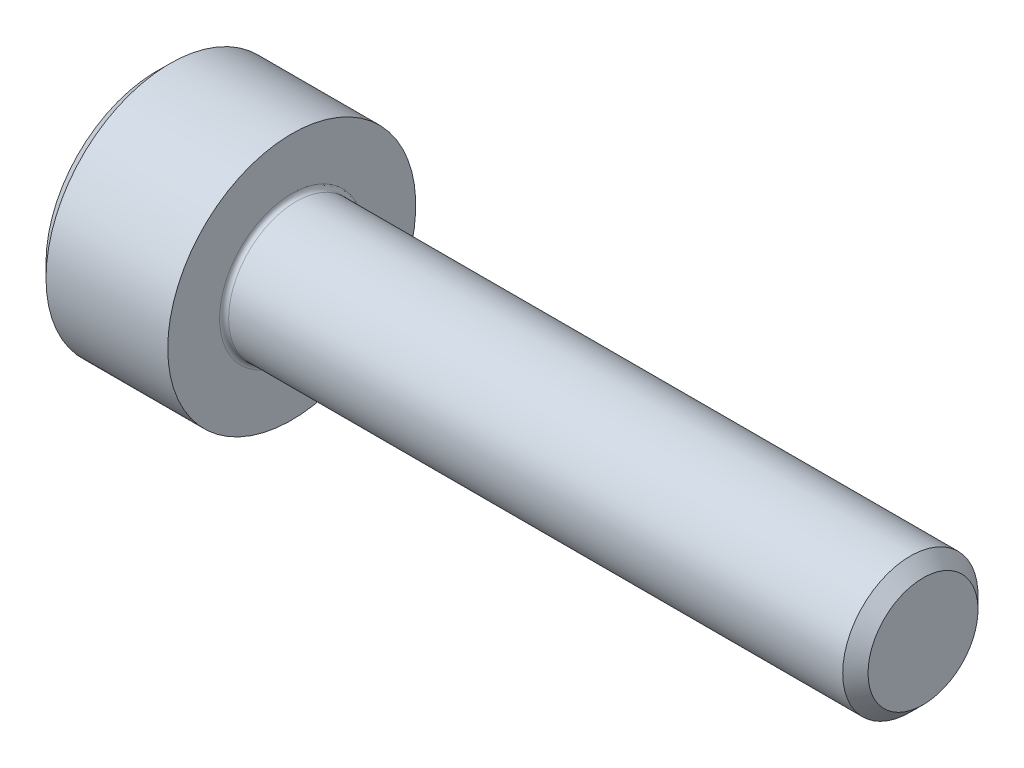
ISO-10303-21;
HEADER;
FILE_DESCRIPTION(('STEP AP214'),'2;1');
FILE_NAME('part.step','',(''),(''),'','','');
FILE_SCHEMA(('AUTOMOTIVE_DESIGN { 1 0 10303 214 1 1 1 1 }'));
ENDSEC;
DATA;
#1=APPLICATION_CONTEXT('core data for automotive mechanical design processes');
#2=APPLICATION_PROTOCOL_DEFINITION('international standard','automotive_design',2000,#1);
#3=PRODUCT_CONTEXT('',#1,'mechanical');
#4=PRODUCT('Part','Part','',(#3));
#5=PRODUCT_RELATED_PRODUCT_CATEGORY('part','',(#4));
#6=PRODUCT_DEFINITION_FORMATION('','',#4);
#7=PRODUCT_DEFINITION_CONTEXT('part definition',#1,'design');
#8=PRODUCT_DEFINITION('design','',#6,#7);
#9=PRODUCT_DEFINITION_SHAPE('','',#8);
#10=(LENGTH_UNIT() NAMED_UNIT(*) SI_UNIT(.MILLI.,.METRE.));
#11=(NAMED_UNIT(*) PLANE_ANGLE_UNIT() SI_UNIT($,.RADIAN.));
#12=(NAMED_UNIT(*) SI_UNIT($,.STERADIAN.) SOLID_ANGLE_UNIT());
#13=UNCERTAINTY_MEASURE_WITH_UNIT(LENGTH_MEASURE(1.E-05),#10,'distance_accuracy_value','');
#14=(GEOMETRIC_REPRESENTATION_CONTEXT(3) GLOBAL_UNCERTAINTY_ASSIGNED_CONTEXT((#13)) GLOBAL_UNIT_ASSIGNED_CONTEXT((#10,
#11,#12)) REPRESENTATION_CONTEXT('',''));
#15=CARTESIAN_POINT('',(0.,0.,0.));
#16=DIRECTION('',(0.,0.,1.));
#17=DIRECTION('',(1.,0.,0.));
#18=AXIS2_PLACEMENT_3D('',#15,#16,#17);
#19=CARTESIAN_POINT('',(0.,0.,0.));
#20=DIRECTION('',(-1.,0.,0.));
#21=DIRECTION('',(0.,0.,1.));
#22=AXIS2_PLACEMENT_3D('',#19,#20,#21);
#23=PLANE('',#22);
#24=DIRECTION('',(0.,-0.5,0.866025403784439));
#25=VECTOR('',#24,1.);
#26=CARTESIAN_POINT('',(0.,1.47801668912544,0.));
#27=LINE('',#26,#25);
#28=CARTESIAN_POINT('',(0.,1.47801668912544,0.));
#29=VERTEX_POINT('',#28);
#30=CARTESIAN_POINT('',(0.,0.739008344562719,1.28));
#31=VERTEX_POINT('',#30);
#32=EDGE_CURVE('E376',#29,#31,#27,.T.);
#33=ORIENTED_EDGE('',*,*,#32,.T.);
#34=DIRECTION('',(0.,1.,0.));
#35=VECTOR('',#34,1.);
#36=CARTESIAN_POINT('',(0.,-0.739008344562723,1.28));
#37=LINE('',#36,#35);
#38=CARTESIAN_POINT('',(0.,-0.739008344562723,1.28));
#39=VERTEX_POINT('',#38);
#40=EDGE_CURVE('E132',#39,#31,#37,.T.);
#41=ORIENTED_EDGE('',*,*,#40,.F.);
#42=DIRECTION('',(0.,-0.500000000000001,-0.866025403784438));
#43=VECTOR('',#42,1.);
#44=CARTESIAN_POINT('',(0.,-0.739008344562723,1.28));
#45=LINE('',#44,#43);
#46=CARTESIAN_POINT('',(0.,-1.47801668912545,0.));
#47=VERTEX_POINT('',#46);
#48=EDGE_CURVE('E379',#39,#47,#45,.T.);
#49=ORIENTED_EDGE('',*,*,#48,.T.);
#50=DIRECTION('',(0.,0.5,-0.866025403784439));
#51=VECTOR('',#50,1.);
#52=CARTESIAN_POINT('',(0.,-1.47801668912545,0.));
#53=LINE('',#52,#51);
#54=CARTESIAN_POINT('',(0.,-0.739008344562725,-1.28));
#55=VERTEX_POINT('',#54);
#56=EDGE_CURVE('E382',#47,#55,#53,.T.);
#57=ORIENTED_EDGE('',*,*,#56,.T.);
#58=DIRECTION('',(0.,-1.,0.));
#59=VECTOR('',#58,1.);
#60=CARTESIAN_POINT('',(0.,0.739008344562717,-1.28));
#61=LINE('',#60,#59);
#62=CARTESIAN_POINT('',(0.,0.739008344562717,-1.28));
#63=VERTEX_POINT('',#62);
#64=EDGE_CURVE('E385',#63,#55,#61,.T.);
#65=ORIENTED_EDGE('',*,*,#64,.F.);
#66=DIRECTION('',(0.,-0.500000000000001,-0.866025403784438));
#67=VECTOR('',#66,1.);
#68=CARTESIAN_POINT('',(0.,1.47801668912544,0.));
#69=LINE('',#68,#67);
#70=EDGE_CURVE('E127',#29,#63,#69,.T.);
#71=ORIENTED_EDGE('',*,*,#70,.F.);
#72=EDGE_LOOP('',(#33,#41,#49,#57,#65,#71));
#73=FACE_BOUND('',#72,.T.);
#74=CARTESIAN_POINT('',(0.,0.,0.));
#75=DIRECTION('',(-1.,0.,0.));
#76=DIRECTION('',(0.,0.,1.));
#77=AXIS2_PLACEMENT_3D('',#74,#75,#76);
#78=CIRCLE('',#77,2.45);
#79=CARTESIAN_POINT('',(0.,0.,2.45));
#80=VERTEX_POINT('',#79);
#81=EDGE_CURVE('E143',#80,#80,#78,.T.);
#82=ORIENTED_EDGE('',*,*,#81,.T.);
#83=EDGE_LOOP('',(#82));
#84=FACE_BOUND('',#83,.T.);
#85=ADVANCED_FACE('F36',(#73,#84),#23,.T.);
#86=CARTESIAN_POINT('',(17.,1.2195,0.));
#87=DIRECTION('',(1.,0.,0.));
#88=DIRECTION('',(0.,0.,-1.));
#89=AXIS2_PLACEMENT_3D('',#86,#87,#88);
#90=PLANE('',#89);
#91=CARTESIAN_POINT('',(17.,0.,0.));
#92=DIRECTION('',(-1.,0.,0.));
#93=DIRECTION('',(0.,0.,1.));
#94=AXIS2_PLACEMENT_3D('',#91,#92,#93);
#95=CIRCLE('',#94,1.2195);
#96=CARTESIAN_POINT('',(17.,0.,1.2195));
#97=VERTEX_POINT('',#96);
#98=EDGE_CURVE('E156',#97,#97,#95,.T.);
#99=ORIENTED_EDGE('',*,*,#98,.F.);
#100=EDGE_LOOP('',(#99));
#101=FACE_BOUND('',#100,.T.);
#102=ADVANCED_FACE('F177',(#101),#90,.T.);
#103=CARTESIAN_POINT('',(17.,0.,0.));
#104=DIRECTION('',(-1.,0.,0.));
#105=DIRECTION('',(0.,0.,1.));
#106=AXIS2_PLACEMENT_3D('',#103,#104,#105);
#107=CONICAL_SURFACE('',#106,1.2195,0.785398163397261);
#108=CARTESIAN_POINT('',(16.7195,0.,0.));
#109=DIRECTION('',(-1.,0.,0.));
#110=DIRECTION('',(0.,0.,1.));
#111=AXIS2_PLACEMENT_3D('',#108,#109,#110);
#112=CIRCLE('',#111,1.49999999999994);
#113=CARTESIAN_POINT('',(16.7195,0.,1.49999999999994));
#114=VERTEX_POINT('',#113);
#115=EDGE_CURVE('E153',#114,#114,#112,.T.);
#116=ORIENTED_EDGE('',*,*,#115,.F.);
#117=EDGE_LOOP('',(#116));
#118=FACE_BOUND('',#117,.T.);
#119=ORIENTED_EDGE('',*,*,#98,.T.);
#120=EDGE_LOOP('',(#119));
#121=FACE_BOUND('',#120,.T.);
#122=ADVANCED_FACE('F183',(#118,#121),#107,.T.);
#123=CARTESIAN_POINT('',(-31.75,0.,0.));
#124=DIRECTION('',(-1.,0.,0.));
#125=DIRECTION('',(0.,0.,1.));
#126=AXIS2_PLACEMENT_3D('',#123,#124,#125);
#127=CYLINDRICAL_SURFACE('',#126,1.49999999999997);
#128=CARTESIAN_POINT('',(3.1,0.,0.));
#129=DIRECTION('',(1.,0.,0.));
#130=DIRECTION('',(0.,0.,-1.));
#131=AXIS2_PLACEMENT_3D('',#128,#129,#130);
#132=CIRCLE('',#131,1.49999999999997);
#133=CARTESIAN_POINT('',(3.1,0.,-1.49999999999997));
#134=VERTEX_POINT('',#133);
#135=EDGE_CURVE('E11',#134,#134,#132,.T.);
#136=ORIENTED_EDGE('',*,*,#135,.T.);
#137=EDGE_LOOP('',(#136));
#138=FACE_BOUND('',#137,.T.);
#139=ORIENTED_EDGE('',*,*,#115,.T.);
#140=EDGE_LOOP('',(#139));
#141=FACE_BOUND('',#140,.T.);
#142=ADVANCED_FACE('F194',(#138,#141),#127,.T.);
#143=CARTESIAN_POINT('',(3.,2.75,0.));
#144=DIRECTION('',(1.,0.,0.));
#145=DIRECTION('',(0.,0.,-1.));
#146=AXIS2_PLACEMENT_3D('',#143,#144,#145);
#147=PLANE('',#146);
#148=CARTESIAN_POINT('',(3.,0.,0.));
#149=DIRECTION('',(1.,0.,0.));
#150=DIRECTION('',(0.,0.,-1.));
#151=AXIS2_PLACEMENT_3D('',#148,#149,#150);
#152=CIRCLE('',#151,1.59999999999997);
#153=CARTESIAN_POINT('',(3.,0.,-1.59999999999997));
#154=VERTEX_POINT('',#153);
#155=EDGE_CURVE('E44',#154,#154,#152,.F.);
#156=ORIENTED_EDGE('',*,*,#155,.T.);
#157=EDGE_LOOP('',(#156));
#158=FACE_BOUND('',#157,.T.);
#159=CARTESIAN_POINT('',(3.,0.,0.));
#160=DIRECTION('',(-1.,0.,0.));
#161=DIRECTION('',(0.,0.,1.));
#162=AXIS2_PLACEMENT_3D('',#159,#160,#161);
#163=CIRCLE('',#162,2.75);
#164=CARTESIAN_POINT('',(3.,0.,2.75));
#165=VERTEX_POINT('',#164);
#166=EDGE_CURVE('E150',#165,#165,#163,.T.);
#167=ORIENTED_EDGE('',*,*,#166,.F.);
#168=EDGE_LOOP('',(#167));
#169=FACE_BOUND('',#168,.T.);
#170=ADVANCED_FACE('F161',(#158,#169),#147,.T.);
#171=CARTESIAN_POINT('',(-31.75,0.,0.));
#172=DIRECTION('',(-1.,0.,0.));
#173=DIRECTION('',(0.,0.,1.));
#174=AXIS2_PLACEMENT_3D('',#171,#172,#173);
#175=CYLINDRICAL_SURFACE('',#174,2.75);
#176=ORIENTED_EDGE('',*,*,#166,.T.);
#177=EDGE_LOOP('',(#176));
#178=FACE_BOUND('',#177,.T.);
#179=CARTESIAN_POINT('',(0.300000000000002,0.,0.));
#180=DIRECTION('',(-1.,0.,0.));
#181=DIRECTION('',(0.,0.,1.));
#182=AXIS2_PLACEMENT_3D('',#179,#180,#181);
#183=CIRCLE('',#182,2.75);
#184=CARTESIAN_POINT('',(0.300000000000002,0.,2.75));
#185=VERTEX_POINT('',#184);
#186=EDGE_CURVE('E147',#185,#185,#183,.T.);
#187=ORIENTED_EDGE('',*,*,#186,.F.);
#188=EDGE_LOOP('',(#187));
#189=FACE_BOUND('',#188,.T.);
#190=ADVANCED_FACE('F172',(#178,#189),#175,.T.);
#191=CARTESIAN_POINT('',(0.,0.,0.));
#192=DIRECTION('',(1.,0.,0.));
#193=DIRECTION('',(0.,0.,-1.));
#194=AXIS2_PLACEMENT_3D('',#191,#192,#193);
#195=CONICAL_SURFACE('',#194,2.45,0.785398163397447);
#196=ORIENTED_EDGE('',*,*,#186,.T.);
#197=EDGE_LOOP('',(#196));
#198=FACE_BOUND('',#197,.T.);
#199=ORIENTED_EDGE('',*,*,#81,.F.);
#200=EDGE_LOOP('',(#199));
#201=FACE_BOUND('',#200,.T.);
#202=ADVANCED_FACE('F165',(#198,#201),#195,.T.);
#203=CARTESIAN_POINT('',(3.1,0.,0.));
#204=DIRECTION('',(1.,0.,0.));
#205=DIRECTION('',(0.,0.,-1.));
#206=AXIS2_PLACEMENT_3D('',#203,#204,#205);
#207=TOROIDAL_SURFACE('',#206,1.59999999999997,0.1);
#208=ORIENTED_EDGE('',*,*,#135,.F.);
#209=EDGE_LOOP('',(#208));
#210=FACE_BOUND('',#209,.T.);
#211=ORIENTED_EDGE('',*,*,#155,.F.);
#212=EDGE_LOOP('',(#211));
#213=FACE_BOUND('',#212,.T.);
#214=ADVANCED_FACE('F38',(#210,#213),#207,.F.);
#215=CARTESIAN_POINT('',(1.3,1.47801668912544,0.));
#216=DIRECTION('',(0.,-0.866025403784439,-0.5));
#217=DIRECTION('',(0.,0.5,-0.866025403784439));
#218=AXIS2_PLACEMENT_3D('',#215,#216,#217);
#219=PLANE('',#218);
#220=ORIENTED_EDGE('',*,*,#32,.F.);
#221=DIRECTION('',(-1.,0.,0.));
#222=VECTOR('',#221,1.);
#223=CARTESIAN_POINT('',(1.3,1.47801668912544,0.));
#224=LINE('',#223,#222);
#225=CARTESIAN_POINT('',(1.3,1.47801668912544,0.));
#226=VERTEX_POINT('',#225);
#227=EDGE_CURVE('E366',#226,#29,#224,.T.);
#228=ORIENTED_EDGE('',*,*,#227,.F.);
#229=DIRECTION('',(0.,-0.5,0.866025403784439));
#230=VECTOR('',#229,1.);
#231=CARTESIAN_POINT('',(1.3,1.47801668912544,0.));
#232=LINE('',#231,#230);
#233=CARTESIAN_POINT('',(1.3,1.10851251684408,0.639999999999998));
#234=VERTEX_POINT('',#233);
#235=EDGE_CURVE('E119',#226,#234,#232,.T.);
#236=ORIENTED_EDGE('',*,*,#235,.T.);
#237=CARTESIAN_POINT('',(1.3,0.739008344562719,1.28));
#238=VERTEX_POINT('',#237);
#239=EDGE_CURVE('E110',#234,#238,#232,.T.);
#240=ORIENTED_EDGE('',*,*,#239,.T.);
#241=DIRECTION('',(-1.,0.,0.));
#242=VECTOR('',#241,1.);
#243=CARTESIAN_POINT('',(1.3,0.739008344562719,1.28));
#244=LINE('',#243,#242);
#245=EDGE_CURVE('E124',#238,#31,#244,.T.);
#246=ORIENTED_EDGE('',*,*,#245,.T.);
#247=EDGE_LOOP('',(#220,#228,#236,#240,#246));
#248=FACE_BOUND('',#247,.T.);
#249=ADVANCED_FACE('F123',(#248),#219,.T.);
#250=CARTESIAN_POINT('',(1.3,-0.739008344562723,1.28));
#251=DIRECTION('',(0.,0.,1.));
#252=DIRECTION('',(0.,-1.,0.));
#253=AXIS2_PLACEMENT_3D('',#250,#251,#252);
#254=PLANE('',#253);
#255=ORIENTED_EDGE('',*,*,#40,.T.);
#256=ORIENTED_EDGE('',*,*,#245,.F.);
#257=DIRECTION('',(0.,1.,0.));
#258=VECTOR('',#257,1.);
#259=CARTESIAN_POINT('',(1.3,-0.739008344562723,1.28));
#260=LINE('',#259,#258);
#261=CARTESIAN_POINT('',(1.3,0.,1.28));
#262=VERTEX_POINT('',#261);
#263=EDGE_CURVE('E107',#262,#238,#260,.T.);
#264=ORIENTED_EDGE('',*,*,#263,.F.);
#265=CARTESIAN_POINT('',(1.3,-0.739008344562723,1.28));
#266=VERTEX_POINT('',#265);
#267=EDGE_CURVE('E118',#266,#262,#260,.T.);
#268=ORIENTED_EDGE('',*,*,#267,.F.);
#269=DIRECTION('',(-1.,0.,0.));
#270=VECTOR('',#269,1.);
#271=CARTESIAN_POINT('',(1.3,-0.739008344562723,1.28));
#272=LINE('',#271,#270);
#273=EDGE_CURVE('E134',#266,#39,#272,.T.);
#274=ORIENTED_EDGE('',*,*,#273,.T.);
#275=EDGE_LOOP('',(#255,#256,#264,#268,#274));
#276=FACE_BOUND('',#275,.T.);
#277=ADVANCED_FACE('F129',(#276),#254,.F.);
#278=CARTESIAN_POINT('',(1.3,-0.739008344562723,1.28));
#279=DIRECTION('',(0.,0.866025403784438,-0.500000000000001));
#280=DIRECTION('',(0.,0.500000000000001,0.866025403784438));
#281=AXIS2_PLACEMENT_3D('',#278,#279,#280);
#282=PLANE('',#281);
#283=ORIENTED_EDGE('',*,*,#48,.F.);
#284=ORIENTED_EDGE('',*,*,#273,.F.);
#285=DIRECTION('',(0.,-0.500000000000001,-0.866025403784438));
#286=VECTOR('',#285,1.);
#287=CARTESIAN_POINT('',(1.3,-0.739008344562723,1.28));
#288=LINE('',#287,#286);
#289=CARTESIAN_POINT('',(1.3,-1.10851251684408,0.640000000000003));
#290=VERTEX_POINT('',#289);
#291=EDGE_CURVE('E405',#266,#290,#288,.T.);
#292=ORIENTED_EDGE('',*,*,#291,.T.);
#293=CARTESIAN_POINT('',(1.3,-1.47801668912545,0.));
#294=VERTEX_POINT('',#293);
#295=EDGE_CURVE('E394',#290,#294,#288,.T.);
#296=ORIENTED_EDGE('',*,*,#295,.T.);
#297=DIRECTION('',(-1.,0.,0.));
#298=VECTOR('',#297,1.);
#299=CARTESIAN_POINT('',(1.3,-1.47801668912545,0.));
#300=LINE('',#299,#298);
#301=EDGE_CURVE('E139',#294,#47,#300,.T.);
#302=ORIENTED_EDGE('',*,*,#301,.T.);
#303=EDGE_LOOP('',(#283,#284,#292,#296,#302));
#304=FACE_BOUND('',#303,.T.);
#305=ADVANCED_FACE('F257',(#304),#282,.T.);
#306=CARTESIAN_POINT('',(1.3,-1.47801668912545,0.));
#307=DIRECTION('',(0.,0.866025403784439,0.5));
#308=DIRECTION('',(0.,-0.5,0.866025403784439));
#309=AXIS2_PLACEMENT_3D('',#306,#307,#308);
#310=PLANE('',#309);
#311=ORIENTED_EDGE('',*,*,#56,.F.);
#312=ORIENTED_EDGE('',*,*,#301,.F.);
#313=DIRECTION('',(0.,0.5,-0.866025403784439));
#314=VECTOR('',#313,1.);
#315=CARTESIAN_POINT('',(1.3,-1.47801668912545,0.));
#316=LINE('',#315,#314);
#317=CARTESIAN_POINT('',(1.3,-1.10851251684409,-0.640000000000002));
#318=VERTEX_POINT('',#317);
#319=EDGE_CURVE('E372',#294,#318,#316,.T.);
#320=ORIENTED_EDGE('',*,*,#319,.T.);
#321=CARTESIAN_POINT('',(1.3,-0.739008344562725,-1.28));
#322=VERTEX_POINT('',#321);
#323=EDGE_CURVE('E404',#318,#322,#316,.T.);
#324=ORIENTED_EDGE('',*,*,#323,.T.);
#325=DIRECTION('',(-1.,0.,0.));
#326=VECTOR('',#325,1.);
#327=CARTESIAN_POINT('',(1.3,-0.739008344562725,-1.28));
#328=LINE('',#327,#326);
#329=EDGE_CURVE('E365',#322,#55,#328,.T.);
#330=ORIENTED_EDGE('',*,*,#329,.T.);
#331=EDGE_LOOP('',(#311,#312,#320,#324,#330));
#332=FACE_BOUND('',#331,.T.);
#333=ADVANCED_FACE('F265',(#332),#310,.T.);
#334=CARTESIAN_POINT('',(1.3,0.739008344562717,-1.28));
#335=DIRECTION('',(0.,0.,-1.));
#336=DIRECTION('',(0.,1.,0.));
#337=AXIS2_PLACEMENT_3D('',#334,#335,#336);
#338=PLANE('',#337);
#339=ORIENTED_EDGE('',*,*,#64,.T.);
#340=ORIENTED_EDGE('',*,*,#329,.F.);
#341=DIRECTION('',(0.,-1.,0.));
#342=VECTOR('',#341,1.);
#343=CARTESIAN_POINT('',(1.3,0.739008344562717,-1.28));
#344=LINE('',#343,#342);
#345=CARTESIAN_POINT('',(1.3,0.,-1.28));
#346=VERTEX_POINT('',#345);
#347=EDGE_CURVE('E369',#346,#322,#344,.T.);
#348=ORIENTED_EDGE('',*,*,#347,.F.);
#349=CARTESIAN_POINT('',(1.3,0.739008344562717,-1.28));
#350=VERTEX_POINT('',#349);
#351=EDGE_CURVE('E51',#350,#346,#344,.T.);
#352=ORIENTED_EDGE('',*,*,#351,.F.);
#353=DIRECTION('',(-1.,0.,0.));
#354=VECTOR('',#353,1.);
#355=CARTESIAN_POINT('',(1.3,0.739008344562717,-1.28));
#356=LINE('',#355,#354);
#357=EDGE_CURVE('E362',#350,#63,#356,.T.);
#358=ORIENTED_EDGE('',*,*,#357,.T.);
#359=EDGE_LOOP('',(#339,#340,#348,#352,#358));
#360=FACE_BOUND('',#359,.T.);
#361=ADVANCED_FACE('F274',(#360),#338,.F.);
#362=CARTESIAN_POINT('',(1.3,1.47801668912544,0.));
#363=DIRECTION('',(0.,0.866025403784438,-0.500000000000001));
#364=DIRECTION('',(0.,0.500000000000001,0.866025403784438));
#365=AXIS2_PLACEMENT_3D('',#362,#363,#364);
#366=PLANE('',#365);
#367=ORIENTED_EDGE('',*,*,#70,.T.);
#368=ORIENTED_EDGE('',*,*,#357,.F.);
#369=DIRECTION('',(0.,-0.500000000000001,-0.866025403784438));
#370=VECTOR('',#369,1.);
#371=CARTESIAN_POINT('',(1.3,1.47801668912544,0.));
#372=LINE('',#371,#370);
#373=CARTESIAN_POINT('',(1.3,1.10851251684408,-0.640000000000001));
#374=VERTEX_POINT('',#373);
#375=EDGE_CURVE('E352',#374,#350,#372,.T.);
#376=ORIENTED_EDGE('',*,*,#375,.F.);
#377=EDGE_CURVE('E358',#226,#374,#372,.T.);
#378=ORIENTED_EDGE('',*,*,#377,.F.);
#379=ORIENTED_EDGE('',*,*,#227,.T.);
#380=EDGE_LOOP('',(#367,#368,#376,#378,#379));
#381=FACE_BOUND('',#380,.T.);
#382=ADVANCED_FACE('F283',(#381),#366,.F.);
#383=CARTESIAN_POINT('',(1.3,1.47801668912544,0.));
#384=DIRECTION('',(1.,0.,0.));
#385=DIRECTION('',(0.,0.,-1.));
#386=AXIS2_PLACEMENT_3D('',#383,#384,#385);
#387=PLANE('',#386);
#388=ORIENTED_EDGE('',*,*,#347,.T.);
#389=ORIENTED_EDGE('',*,*,#323,.F.);
#390=CARTESIAN_POINT('',(1.3,0.,0.));
#391=DIRECTION('',(-1.,0.,0.));
#392=DIRECTION('',(0.,0.,1.));
#393=AXIS2_PLACEMENT_3D('',#390,#391,#392);
#394=CIRCLE('',#393,1.28);
#395=EDGE_CURVE('E400',#346,#318,#394,.T.);
#396=ORIENTED_EDGE('',*,*,#395,.F.);
#397=EDGE_LOOP('',(#388,#389,#396));
#398=FACE_BOUND('',#397,.T.);
#399=ADVANCED_FACE('F292',(#398),#387,.F.);
#400=ORIENTED_EDGE('',*,*,#319,.F.);
#401=ORIENTED_EDGE('',*,*,#295,.F.);
#402=EDGE_CURVE('E137',#318,#290,#394,.T.);
#403=ORIENTED_EDGE('',*,*,#402,.F.);
#404=EDGE_LOOP('',(#400,#401,#403));
#405=FACE_BOUND('',#404,.T.);
#406=ADVANCED_FACE('F301',(#405),#387,.F.);
#407=ORIENTED_EDGE('',*,*,#291,.F.);
#408=ORIENTED_EDGE('',*,*,#267,.T.);
#409=EDGE_CURVE('E133',#290,#262,#394,.T.);
#410=ORIENTED_EDGE('',*,*,#409,.F.);
#411=EDGE_LOOP('',(#407,#408,#410));
#412=FACE_BOUND('',#411,.T.);
#413=ADVANCED_FACE('F310',(#412),#387,.F.);
#414=ORIENTED_EDGE('',*,*,#263,.T.);
#415=ORIENTED_EDGE('',*,*,#239,.F.);
#416=EDGE_CURVE('E113',#262,#234,#394,.T.);
#417=ORIENTED_EDGE('',*,*,#416,.F.);
#418=EDGE_LOOP('',(#414,#415,#417));
#419=FACE_BOUND('',#418,.T.);
#420=ADVANCED_FACE('F109',(#419),#387,.F.);
#421=ORIENTED_EDGE('',*,*,#235,.F.);
#422=ORIENTED_EDGE('',*,*,#377,.T.);
#423=EDGE_CURVE('E144',#234,#374,#394,.T.);
#424=ORIENTED_EDGE('',*,*,#423,.F.);
#425=EDGE_LOOP('',(#421,#422,#424));
#426=FACE_BOUND('',#425,.T.);
#427=ADVANCED_FACE('F325',(#426),#387,.F.);
#428=ORIENTED_EDGE('',*,*,#375,.T.);
#429=ORIENTED_EDGE('',*,*,#351,.T.);
#430=EDGE_CURVE('E355',#374,#346,#394,.T.);
#431=ORIENTED_EDGE('',*,*,#430,.F.);
#432=EDGE_LOOP('',(#428,#429,#431));
#433=FACE_BOUND('',#432,.T.);
#434=ADVANCED_FACE('F240',(#433),#387,.F.);
#435=CARTESIAN_POINT('',(1.3,0.,0.));
#436=DIRECTION('',(-1.,0.,0.));
#437=DIRECTION('',(0.,0.,1.));
#438=AXIS2_PLACEMENT_3D('',#435,#436,#437);
#439=CONICAL_SURFACE('',#438,1.28,1.0471975511966);
#440=CARTESIAN_POINT('',(2.03900834456273,0.,0.));
#441=VERTEX_POINT('',#440);
#442=VERTEX_LOOP('',#441);
#443=FACE_BOUND('',#442,.T.);
#444=ORIENTED_EDGE('',*,*,#416,.T.);
#445=ORIENTED_EDGE('',*,*,#423,.T.);
#446=ORIENTED_EDGE('',*,*,#430,.T.);
#447=ORIENTED_EDGE('',*,*,#395,.T.);
#448=ORIENTED_EDGE('',*,*,#402,.T.);
#449=ORIENTED_EDGE('',*,*,#409,.T.);
#450=EDGE_LOOP('',(#444,#445,#446,#447,#448,#449));
#451=FACE_BOUND('',#450,.T.);
#452=ADVANCED_FACE('F187',(#443,#451),#439,.F.);
#453=CLOSED_SHELL('',(#85,#102,#122,#142,#170,#190,#202,#214,#249,#277,#305,#333,#361,#382,#399,
#406,#413,#420,#427,#434,#452));
#454=MANIFOLD_SOLID_BREP('B2',#453);
#455=ADVANCED_BREP_SHAPE_REPRESENTATION('',(#18,#454),#14);
#456=SHAPE_DEFINITION_REPRESENTATION(#9,#455);
ENDSEC;
END-ISO-10303-21;
